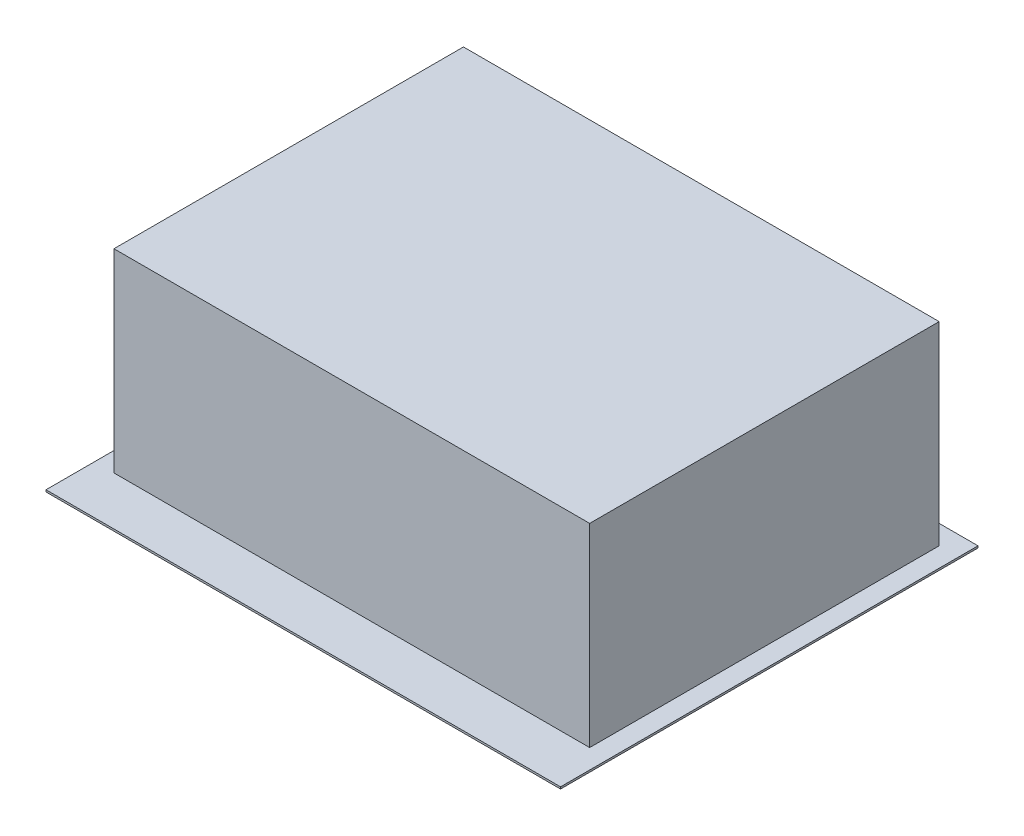
ISO-10303-21;
HEADER;
FILE_DESCRIPTION(('STEP AP214'),'2;1');
FILE_NAME('part.step','',(''),(''),'','','');
FILE_SCHEMA(('AUTOMOTIVE_DESIGN { 1 0 10303 214 1 1 1 1 }'));
ENDSEC;
DATA;
#1=APPLICATION_CONTEXT('core data for automotive mechanical design processes');
#2=APPLICATION_PROTOCOL_DEFINITION('international standard','automotive_design',2000,#1);
#3=PRODUCT_CONTEXT('',#1,'mechanical');
#4=PRODUCT('Part','Part','',(#3));
#5=PRODUCT_RELATED_PRODUCT_CATEGORY('part','',(#4));
#6=PRODUCT_DEFINITION_FORMATION('','',#4);
#7=PRODUCT_DEFINITION_CONTEXT('part definition',#1,'design');
#8=PRODUCT_DEFINITION('design','',#6,#7);
#9=PRODUCT_DEFINITION_SHAPE('','',#8);
#10=(LENGTH_UNIT() NAMED_UNIT(*) SI_UNIT(.MILLI.,.METRE.));
#11=(NAMED_UNIT(*) PLANE_ANGLE_UNIT() SI_UNIT($,.RADIAN.));
#12=(NAMED_UNIT(*) SI_UNIT($,.STERADIAN.) SOLID_ANGLE_UNIT());
#13=UNCERTAINTY_MEASURE_WITH_UNIT(LENGTH_MEASURE(1.E-05),#10,'distance_accuracy_value','');
#14=(GEOMETRIC_REPRESENTATION_CONTEXT(3) GLOBAL_UNCERTAINTY_ASSIGNED_CONTEXT((#13)) GLOBAL_UNIT_ASSIGNED_CONTEXT((#10,
#11,#12)) REPRESENTATION_CONTEXT('',''));
#15=CARTESIAN_POINT('',(0.,0.,0.));
#16=DIRECTION('',(0.,0.,1.));
#17=DIRECTION('',(1.,0.,0.));
#18=AXIS2_PLACEMENT_3D('',#15,#16,#17);
#19=CARTESIAN_POINT('',(22.,192.,-410.));
#20=DIRECTION('',(1.,0.,0.));
#21=DIRECTION('',(0.,0.,-1.));
#22=AXIS2_PLACEMENT_3D('',#19,#20,#21);
#23=PLANE('',#22);
#24=DIRECTION('',(0.,0.,1.));
#25=VECTOR('',#24,1.);
#26=CARTESIAN_POINT('',(22.,192.,-410.));
#27=LINE('',#26,#25);
#28=CARTESIAN_POINT('',(22.,192.,-408.));
#29=VERTEX_POINT('',#28);
#30=CARTESIAN_POINT('',(22.,192.,-402.));
#31=VERTEX_POINT('',#30);
#32=EDGE_CURVE('E153',#29,#31,#27,.T.);
#33=ORIENTED_EDGE('',*,*,#32,.T.);
#34=DIRECTION('',(0.,-1.,0.));
#35=VECTOR('',#34,1.);
#36=CARTESIAN_POINT('',(22.,200.,-402.));
#37=LINE('',#36,#35);
#38=CARTESIAN_POINT('',(22.,200.,-402.));
#39=VERTEX_POINT('',#38);
#40=EDGE_CURVE('E59',#39,#31,#37,.T.);
#41=ORIENTED_EDGE('',*,*,#40,.F.);
#42=DIRECTION('',(0.,0.,-1.));
#43=VECTOR('',#42,1.);
#44=CARTESIAN_POINT('',(22.,200.,-52.));
#45=LINE('',#44,#43);
#46=CARTESIAN_POINT('',(22.,200.,-52.));
#47=VERTEX_POINT('',#46);
#48=EDGE_CURVE('E149',#47,#39,#45,.T.);
#49=ORIENTED_EDGE('',*,*,#48,.F.);
#50=DIRECTION('',(0.,-1.,0.));
#51=VECTOR('',#50,1.);
#52=CARTESIAN_POINT('',(22.,192.,-52.));
#53=LINE('',#52,#51);
#54=CARTESIAN_POINT('',(22.,0.,-52.));
#55=VERTEX_POINT('',#54);
#56=EDGE_CURVE('E207',#47,#55,#53,.T.);
#57=ORIENTED_EDGE('',*,*,#56,.T.);
#58=DIRECTION('',(0.,0.,-1.));
#59=VECTOR('',#58,1.);
#60=CARTESIAN_POINT('',(22.,0.,-52.));
#61=LINE('',#60,#59);
#62=CARTESIAN_POINT('',(22.,0.,-402.));
#63=VERTEX_POINT('',#62);
#64=EDGE_CURVE('E51',#55,#63,#61,.T.);
#65=ORIENTED_EDGE('',*,*,#64,.T.);
#66=CARTESIAN_POINT('',(22.,12.,-402.));
#67=VERTEX_POINT('',#66);
#68=EDGE_CURVE('E155',#67,#63,#37,.T.);
#69=ORIENTED_EDGE('',*,*,#68,.F.);
#70=DIRECTION('',(0.,0.,1.));
#71=VECTOR('',#70,1.);
#72=CARTESIAN_POINT('',(22.,12.,-410.));
#73=LINE('',#72,#71);
#74=CARTESIAN_POINT('',(22.,12.,-408.));
#75=VERTEX_POINT('',#74);
#76=EDGE_CURVE('E187',#75,#67,#73,.T.);
#77=ORIENTED_EDGE('',*,*,#76,.F.);
#78=DIRECTION('',(0.,-1.,0.));
#79=VECTOR('',#78,1.);
#80=CARTESIAN_POINT('',(22.,192.,-408.));
#81=LINE('',#80,#79);
#82=EDGE_CURVE('E194',#29,#75,#81,.T.);
#83=ORIENTED_EDGE('',*,*,#82,.F.);
#84=EDGE_LOOP('',(#33,#41,#49,#57,#65,#69,#77,#83));
#85=FACE_BOUND('',#84,.T.);
#86=ADVANCED_FACE('F36',(#85),#23,.T.);
#87=CARTESIAN_POINT('',(20.,192.,-52.));
#88=DIRECTION('',(0.,0.,-1.));
#89=DIRECTION('',(-1.,0.,0.));
#90=AXIS2_PLACEMENT_3D('',#87,#88,#89);
#91=PLANE('',#90);
#92=DIRECTION('',(0.,-1.,0.));
#93=VECTOR('',#92,1.);
#94=CARTESIAN_POINT('',(508.,192.,-52.));
#95=LINE('',#94,#93);
#96=CARTESIAN_POINT('',(508.,200.,-52.));
#97=VERTEX_POINT('',#96);
#98=CARTESIAN_POINT('',(508.,0.,-52.));
#99=VERTEX_POINT('',#98);
#100=EDGE_CURVE('E205',#97,#99,#95,.T.);
#101=ORIENTED_EDGE('',*,*,#100,.T.);
#102=DIRECTION('',(-1.,0.,0.));
#103=VECTOR('',#102,1.);
#104=CARTESIAN_POINT('',(22.,0.,-52.));
#105=LINE('',#104,#103);
#106=EDGE_CURVE('E170',#99,#55,#105,.T.);
#107=ORIENTED_EDGE('',*,*,#106,.T.);
#108=ORIENTED_EDGE('',*,*,#56,.F.);
#109=DIRECTION('',(-1.,0.,0.));
#110=VECTOR('',#109,1.);
#111=CARTESIAN_POINT('',(22.,200.,-52.));
#112=LINE('',#111,#110);
#113=EDGE_CURVE('E169',#97,#47,#112,.T.);
#114=ORIENTED_EDGE('',*,*,#113,.F.);
#115=EDGE_LOOP('',(#101,#107,#108,#114));
#116=FACE_BOUND('',#115,.T.);
#117=ADVANCED_FACE('F319',(#116),#91,.T.);
#118=CARTESIAN_POINT('',(508.,192.,-410.));
#119=DIRECTION('',(-1.,0.,0.));
#120=DIRECTION('',(0.,0.,1.));
#121=AXIS2_PLACEMENT_3D('',#118,#119,#120);
#122=PLANE('',#121);
#123=DIRECTION('',(0.,0.,-1.));
#124=VECTOR('',#123,1.);
#125=CARTESIAN_POINT('',(508.,12.,-410.));
#126=LINE('',#125,#124);
#127=CARTESIAN_POINT('',(508.,12.,-402.));
#128=VERTEX_POINT('',#127);
#129=CARTESIAN_POINT('',(508.,12.,-408.));
#130=VERTEX_POINT('',#129);
#131=EDGE_CURVE('E197',#128,#130,#126,.T.);
#132=ORIENTED_EDGE('',*,*,#131,.F.);
#133=DIRECTION('',(0.,-1.,0.));
#134=VECTOR('',#133,1.);
#135=CARTESIAN_POINT('',(508.,200.,-402.));
#136=LINE('',#135,#134);
#137=CARTESIAN_POINT('',(508.,0.,-402.));
#138=VERTEX_POINT('',#137);
#139=EDGE_CURVE('E154',#128,#138,#136,.T.);
#140=ORIENTED_EDGE('',*,*,#139,.T.);
#141=DIRECTION('',(0.,0.,1.));
#142=VECTOR('',#141,1.);
#143=CARTESIAN_POINT('',(508.,0.,-52.));
#144=LINE('',#143,#142);
#145=EDGE_CURVE('E173',#138,#99,#144,.T.);
#146=ORIENTED_EDGE('',*,*,#145,.T.);
#147=ORIENTED_EDGE('',*,*,#100,.F.);
#148=DIRECTION('',(0.,0.,1.));
#149=VECTOR('',#148,1.);
#150=CARTESIAN_POINT('',(508.,200.,-52.));
#151=LINE('',#150,#149);
#152=CARTESIAN_POINT('',(508.,200.,-402.));
#153=VERTEX_POINT('',#152);
#154=EDGE_CURVE('E165',#153,#97,#151,.T.);
#155=ORIENTED_EDGE('',*,*,#154,.F.);
#156=CARTESIAN_POINT('',(508.,192.,-402.));
#157=VERTEX_POINT('',#156);
#158=EDGE_CURVE('E161',#153,#157,#136,.T.);
#159=ORIENTED_EDGE('',*,*,#158,.T.);
#160=DIRECTION('',(0.,0.,-1.));
#161=VECTOR('',#160,1.);
#162=CARTESIAN_POINT('',(508.,192.,-410.));
#163=LINE('',#162,#161);
#164=CARTESIAN_POINT('',(508.,192.,-408.));
#165=VERTEX_POINT('',#164);
#166=EDGE_CURVE('E189',#157,#165,#163,.T.);
#167=ORIENTED_EDGE('',*,*,#166,.T.);
#168=DIRECTION('',(0.,-1.,0.));
#169=VECTOR('',#168,1.);
#170=CARTESIAN_POINT('',(508.,192.,-408.));
#171=LINE('',#170,#169);
#172=EDGE_CURVE('E202',#165,#130,#171,.T.);
#173=ORIENTED_EDGE('',*,*,#172,.T.);
#174=EDGE_LOOP('',(#132,#140,#146,#147,#155,#159,#167,#173));
#175=FACE_BOUND('',#174,.T.);
#176=ADVANCED_FACE('F324',(#175),#122,.T.);
#177=CARTESIAN_POINT('',(20.,192.,-408.));
#178=DIRECTION('',(0.,0.,1.));
#179=DIRECTION('',(1.,0.,0.));
#180=AXIS2_PLACEMENT_3D('',#177,#178,#179);
#181=PLANE('',#180);
#182=DIRECTION('',(-1.,0.,0.));
#183=VECTOR('',#182,1.);
#184=CARTESIAN_POINT('',(20.,12.,-408.));
#185=LINE('',#184,#183);
#186=EDGE_CURVE('E190',#130,#75,#185,.T.);
#187=ORIENTED_EDGE('',*,*,#186,.F.);
#188=ORIENTED_EDGE('',*,*,#172,.F.);
#189=DIRECTION('',(-1.,0.,0.));
#190=VECTOR('',#189,1.);
#191=CARTESIAN_POINT('',(20.,192.,-408.));
#192=LINE('',#191,#190);
#193=EDGE_CURVE('E192',#165,#29,#192,.T.);
#194=ORIENTED_EDGE('',*,*,#193,.T.);
#195=ORIENTED_EDGE('',*,*,#82,.T.);
#196=EDGE_LOOP('',(#187,#188,#194,#195));
#197=FACE_BOUND('',#196,.T.);
#198=ADVANCED_FACE('F346',(#197),#181,.T.);
#199=CARTESIAN_POINT('',(0.,192.,0.));
#200=DIRECTION('',(0.,1.,0.));
#201=DIRECTION('',(0.,0.,1.));
#202=AXIS2_PLACEMENT_3D('',#199,#200,#201);
#203=PLANE('',#202);
#204=ORIENTED_EDGE('',*,*,#166,.F.);
#205=DIRECTION('',(-1.,0.,0.));
#206=VECTOR('',#205,1.);
#207=CARTESIAN_POINT('',(0.,192.,-402.));
#208=LINE('',#207,#206);
#209=EDGE_CURVE('E184',#157,#31,#208,.T.);
#210=ORIENTED_EDGE('',*,*,#209,.T.);
#211=ORIENTED_EDGE('',*,*,#32,.F.);
#212=ORIENTED_EDGE('',*,*,#193,.F.);
#213=EDGE_LOOP('',(#204,#210,#211,#212));
#214=FACE_BOUND('',#213,.T.);
#215=ADVANCED_FACE('F350',(#214),#203,.F.);
#216=CARTESIAN_POINT('',(0.,12.,0.));
#217=DIRECTION('',(0.,1.,0.));
#218=DIRECTION('',(0.,0.,1.));
#219=AXIS2_PLACEMENT_3D('',#216,#217,#218);
#220=PLANE('',#219);
#221=DIRECTION('',(-1.,0.,0.));
#222=VECTOR('',#221,1.);
#223=CARTESIAN_POINT('',(0.,12.,-402.));
#224=LINE('',#223,#222);
#225=EDGE_CURVE('E11',#128,#67,#224,.T.);
#226=ORIENTED_EDGE('',*,*,#225,.F.);
#227=ORIENTED_EDGE('',*,*,#131,.T.);
#228=ORIENTED_EDGE('',*,*,#186,.T.);
#229=ORIENTED_EDGE('',*,*,#76,.T.);
#230=EDGE_LOOP('',(#226,#227,#228,#229));
#231=FACE_BOUND('',#230,.T.);
#232=ADVANCED_FACE('F383',(#231),#220,.T.);
#233=CARTESIAN_POINT('',(22.,200.,-402.));
#234=DIRECTION('',(0.,0.,-1.));
#235=DIRECTION('',(-1.,0.,0.));
#236=AXIS2_PLACEMENT_3D('',#233,#234,#235);
#237=PLANE('',#236);
#238=ORIENTED_EDGE('',*,*,#225,.T.);
#239=ORIENTED_EDGE('',*,*,#68,.T.);
#240=DIRECTION('',(1.,0.,0.));
#241=VECTOR('',#240,1.);
#242=CARTESIAN_POINT('',(22.,0.,-402.));
#243=LINE('',#242,#241);
#244=EDGE_CURVE('E179',#63,#138,#243,.T.);
#245=ORIENTED_EDGE('',*,*,#244,.T.);
#246=ORIENTED_EDGE('',*,*,#139,.F.);
#247=EDGE_LOOP('',(#238,#239,#245,#246));
#248=FACE_BOUND('',#247,.T.);
#249=ADVANCED_FACE('F392',(#248),#237,.F.);
#250=ORIENTED_EDGE('',*,*,#158,.F.);
#251=DIRECTION('',(1.,0.,0.));
#252=VECTOR('',#251,1.);
#253=CARTESIAN_POINT('',(22.,200.,-402.));
#254=LINE('',#253,#252);
#255=EDGE_CURVE('E158',#39,#153,#254,.T.);
#256=ORIENTED_EDGE('',*,*,#255,.F.);
#257=ORIENTED_EDGE('',*,*,#40,.T.);
#258=ORIENTED_EDGE('',*,*,#209,.F.);
#259=EDGE_LOOP('',(#250,#256,#257,#258));
#260=FACE_BOUND('',#259,.T.);
#261=ADVANCED_FACE('F159',(#260),#237,.F.);
#262=CARTESIAN_POINT('',(0.,200.,0.));
#263=DIRECTION('',(0.,-1.,0.));
#264=DIRECTION('',(0.,0.,-1.));
#265=AXIS2_PLACEMENT_3D('',#262,#263,#264);
#266=PLANE('',#265);
#267=ORIENTED_EDGE('',*,*,#48,.T.);
#268=ORIENTED_EDGE('',*,*,#255,.T.);
#269=ORIENTED_EDGE('',*,*,#154,.T.);
#270=ORIENTED_EDGE('',*,*,#113,.T.);
#271=EDGE_LOOP('',(#267,#268,#269,#270));
#272=FACE_BOUND('',#271,.T.);
#273=ADVANCED_FACE('F167',(#272),#266,.T.);
#274=CARTESIAN_POINT('',(0.,2.,0.));
#275=DIRECTION('',(0.,-1.,0.));
#276=DIRECTION('',(0.,0.,-1.));
#277=AXIS2_PLACEMENT_3D('',#274,#275,#276);
#278=PLANE('',#277);
#279=DIRECTION('',(0.,0.,1.));
#280=VECTOR('',#279,1.);
#281=CARTESIAN_POINT('',(0.,2.,0.));
#282=LINE('',#281,#280);
#283=CARTESIAN_POINT('',(0.,2.,-430.));
#284=VERTEX_POINT('',#283);
#285=CARTESIAN_POINT('',(0.,2.,0.));
#286=VERTEX_POINT('',#285);
#287=EDGE_CURVE('E243',#284,#286,#282,.T.);
#288=ORIENTED_EDGE('',*,*,#287,.T.);
#289=DIRECTION('',(1.,0.,0.));
#290=VECTOR('',#289,1.);
#291=CARTESIAN_POINT('',(0.,2.,0.));
#292=LINE('',#291,#290);
#293=CARTESIAN_POINT('',(530.,2.,0.));
#294=VERTEX_POINT('',#293);
#295=EDGE_CURVE('E246',#286,#294,#292,.T.);
#296=ORIENTED_EDGE('',*,*,#295,.T.);
#297=DIRECTION('',(0.,0.,-1.));
#298=VECTOR('',#297,1.);
#299=CARTESIAN_POINT('',(530.,2.,0.));
#300=LINE('',#299,#298);
#301=CARTESIAN_POINT('',(530.,2.,-430.));
#302=VERTEX_POINT('',#301);
#303=EDGE_CURVE('E249',#294,#302,#300,.T.);
#304=ORIENTED_EDGE('',*,*,#303,.T.);
#305=DIRECTION('',(-1.,0.,0.));
#306=VECTOR('',#305,1.);
#307=CARTESIAN_POINT('',(0.,2.,-430.));
#308=LINE('',#307,#306);
#309=EDGE_CURVE('E251',#302,#284,#308,.T.);
#310=ORIENTED_EDGE('',*,*,#309,.T.);
#311=EDGE_LOOP('',(#288,#296,#304,#310));
#312=FACE_BOUND('',#311,.T.);
#313=DIRECTION('',(0.,0.,1.));
#314=VECTOR('',#313,1.);
#315=CARTESIAN_POINT('',(20.,2.,-410.));
#316=LINE('',#315,#314);
#317=CARTESIAN_POINT('',(20.,2.,-410.));
#318=VERTEX_POINT('',#317);
#319=CARTESIAN_POINT('',(20.,2.,-50.));
#320=VERTEX_POINT('',#319);
#321=EDGE_CURVE('E209',#318,#320,#316,.T.);
#322=ORIENTED_EDGE('',*,*,#321,.F.);
#323=DIRECTION('',(-1.,0.,0.));
#324=VECTOR('',#323,1.);
#325=CARTESIAN_POINT('',(20.,2.,-410.));
#326=LINE('',#325,#324);
#327=CARTESIAN_POINT('',(510.,2.,-410.));
#328=VERTEX_POINT('',#327);
#329=EDGE_CURVE('E214',#328,#318,#326,.T.);
#330=ORIENTED_EDGE('',*,*,#329,.F.);
#331=DIRECTION('',(0.,0.,-1.));
#332=VECTOR('',#331,1.);
#333=CARTESIAN_POINT('',(510.,2.,-410.));
#334=LINE('',#333,#332);
#335=CARTESIAN_POINT('',(510.,2.,-50.));
#336=VERTEX_POINT('',#335);
#337=EDGE_CURVE('E226',#336,#328,#334,.T.);
#338=ORIENTED_EDGE('',*,*,#337,.F.);
#339=DIRECTION('',(1.,0.,0.));
#340=VECTOR('',#339,1.);
#341=CARTESIAN_POINT('',(20.,2.,-50.));
#342=LINE('',#341,#340);
#343=EDGE_CURVE('E223',#320,#336,#342,.T.);
#344=ORIENTED_EDGE('',*,*,#343,.F.);
#345=EDGE_LOOP('',(#322,#330,#338,#344));
#346=FACE_BOUND('',#345,.T.);
#347=ADVANCED_FACE('F289',(#312,#346),#278,.F.);
#348=CARTESIAN_POINT('',(0.,2.,0.));
#349=DIRECTION('',(1.,0.,0.));
#350=DIRECTION('',(0.,0.,-1.));
#351=AXIS2_PLACEMENT_3D('',#348,#349,#350);
#352=PLANE('',#351);
#353=DIRECTION('',(0.,0.,1.));
#354=VECTOR('',#353,1.);
#355=CARTESIAN_POINT('',(0.,0.,0.));
#356=LINE('',#355,#354);
#357=CARTESIAN_POINT('',(0.,0.,-430.));
#358=VERTEX_POINT('',#357);
#359=CARTESIAN_POINT('',(0.,0.,0.));
#360=VERTEX_POINT('',#359);
#361=EDGE_CURVE('E242',#358,#360,#356,.T.);
#362=ORIENTED_EDGE('',*,*,#361,.T.);
#363=DIRECTION('',(0.,-1.,0.));
#364=VECTOR('',#363,1.);
#365=CARTESIAN_POINT('',(0.,2.,0.));
#366=LINE('',#365,#364);
#367=EDGE_CURVE('E44',#286,#360,#366,.T.);
#368=ORIENTED_EDGE('',*,*,#367,.F.);
#369=ORIENTED_EDGE('',*,*,#287,.F.);
#370=DIRECTION('',(0.,-1.,0.));
#371=VECTOR('',#370,1.);
#372=CARTESIAN_POINT('',(0.,2.,-430.));
#373=LINE('',#372,#371);
#374=EDGE_CURVE('E253',#284,#358,#373,.T.);
#375=ORIENTED_EDGE('',*,*,#374,.T.);
#376=EDGE_LOOP('',(#362,#368,#369,#375));
#377=FACE_BOUND('',#376,.T.);
#378=ADVANCED_FACE('F38',(#377),#352,.F.);
#379=CARTESIAN_POINT('',(0.,2.,0.));
#380=DIRECTION('',(0.,0.,-1.));
#381=DIRECTION('',(-1.,0.,0.));
#382=AXIS2_PLACEMENT_3D('',#379,#380,#381);
#383=PLANE('',#382);
#384=DIRECTION('',(1.,0.,0.));
#385=VECTOR('',#384,1.);
#386=CARTESIAN_POINT('',(0.,0.,0.));
#387=LINE('',#386,#385);
#388=CARTESIAN_POINT('',(530.,0.,0.));
#389=VERTEX_POINT('',#388);
#390=EDGE_CURVE('E256',#360,#389,#387,.T.);
#391=ORIENTED_EDGE('',*,*,#390,.T.);
#392=DIRECTION('',(0.,-1.,0.));
#393=VECTOR('',#392,1.);
#394=CARTESIAN_POINT('',(530.,2.,0.));
#395=LINE('',#394,#393);
#396=EDGE_CURVE('E266',#294,#389,#395,.T.);
#397=ORIENTED_EDGE('',*,*,#396,.F.);
#398=ORIENTED_EDGE('',*,*,#295,.F.);
#399=ORIENTED_EDGE('',*,*,#367,.T.);
#400=EDGE_LOOP('',(#391,#397,#398,#399));
#401=FACE_BOUND('',#400,.T.);
#402=ADVANCED_FACE('F271',(#401),#383,.F.);
#403=CARTESIAN_POINT('',(530.,2.,0.));
#404=DIRECTION('',(-1.,0.,0.));
#405=DIRECTION('',(0.,0.,1.));
#406=AXIS2_PLACEMENT_3D('',#403,#404,#405);
#407=PLANE('',#406);
#408=DIRECTION('',(0.,0.,-1.));
#409=VECTOR('',#408,1.);
#410=CARTESIAN_POINT('',(530.,0.,0.));
#411=LINE('',#410,#409);
#412=CARTESIAN_POINT('',(530.,0.,-430.));
#413=VERTEX_POINT('',#412);
#414=EDGE_CURVE('E258',#389,#413,#411,.T.);
#415=ORIENTED_EDGE('',*,*,#414,.T.);
#416=DIRECTION('',(0.,-1.,0.));
#417=VECTOR('',#416,1.);
#418=CARTESIAN_POINT('',(530.,2.,-430.));
#419=LINE('',#418,#417);
#420=EDGE_CURVE('E263',#302,#413,#419,.T.);
#421=ORIENTED_EDGE('',*,*,#420,.F.);
#422=ORIENTED_EDGE('',*,*,#303,.F.);
#423=ORIENTED_EDGE('',*,*,#396,.T.);
#424=EDGE_LOOP('',(#415,#421,#422,#423));
#425=FACE_BOUND('',#424,.T.);
#426=ADVANCED_FACE('F283',(#425),#407,.F.);
#427=CARTESIAN_POINT('',(0.,2.,-430.));
#428=DIRECTION('',(0.,0.,1.));
#429=DIRECTION('',(1.,0.,0.));
#430=AXIS2_PLACEMENT_3D('',#427,#428,#429);
#431=PLANE('',#430);
#432=DIRECTION('',(-1.,0.,0.));
#433=VECTOR('',#432,1.);
#434=CARTESIAN_POINT('',(0.,0.,-430.));
#435=LINE('',#434,#433);
#436=EDGE_CURVE('E247',#413,#358,#435,.T.);
#437=ORIENTED_EDGE('',*,*,#436,.T.);
#438=ORIENTED_EDGE('',*,*,#374,.F.);
#439=ORIENTED_EDGE('',*,*,#309,.F.);
#440=ORIENTED_EDGE('',*,*,#420,.T.);
#441=EDGE_LOOP('',(#437,#438,#439,#440));
#442=FACE_BOUND('',#441,.T.);
#443=ADVANCED_FACE('F287',(#442),#431,.F.);
#444=CARTESIAN_POINT('',(0.,0.,0.));
#445=DIRECTION('',(0.,-1.,0.));
#446=DIRECTION('',(0.,0.,-1.));
#447=AXIS2_PLACEMENT_3D('',#444,#445,#446);
#448=PLANE('',#447);
#449=ORIENTED_EDGE('',*,*,#64,.F.);
#450=ORIENTED_EDGE('',*,*,#106,.F.);
#451=ORIENTED_EDGE('',*,*,#145,.F.);
#452=ORIENTED_EDGE('',*,*,#244,.F.);
#453=EDGE_LOOP('',(#449,#450,#451,#452));
#454=FACE_BOUND('',#453,.T.);
#455=ORIENTED_EDGE('',*,*,#361,.F.);
#456=ORIENTED_EDGE('',*,*,#436,.F.);
#457=ORIENTED_EDGE('',*,*,#414,.F.);
#458=ORIENTED_EDGE('',*,*,#390,.F.);
#459=EDGE_LOOP('',(#455,#456,#457,#458));
#460=FACE_BOUND('',#459,.T.);
#461=ADVANCED_FACE('F279',(#454,#460),#448,.T.);
#462=CARTESIAN_POINT('',(20.,202.,-410.));
#463=DIRECTION('',(1.,0.,0.));
#464=DIRECTION('',(0.,0.,-1.));
#465=AXIS2_PLACEMENT_3D('',#462,#463,#464);
#466=PLANE('',#465);
#467=ORIENTED_EDGE('',*,*,#321,.T.);
#468=DIRECTION('',(0.,-1.,0.));
#469=VECTOR('',#468,1.);
#470=CARTESIAN_POINT('',(20.,202.,-50.));
#471=LINE('',#470,#469);
#472=CARTESIAN_POINT('',(20.,202.,-50.));
#473=VERTEX_POINT('',#472);
#474=EDGE_CURVE('E239',#473,#320,#471,.T.);
#475=ORIENTED_EDGE('',*,*,#474,.F.);
#476=DIRECTION('',(0.,0.,1.));
#477=VECTOR('',#476,1.);
#478=CARTESIAN_POINT('',(20.,202.,-410.));
#479=LINE('',#478,#477);
#480=CARTESIAN_POINT('',(20.,202.,-410.));
#481=VERTEX_POINT('',#480);
#482=EDGE_CURVE('E210',#481,#473,#479,.T.);
#483=ORIENTED_EDGE('',*,*,#482,.F.);
#484=DIRECTION('',(0.,-1.,0.));
#485=VECTOR('',#484,1.);
#486=CARTESIAN_POINT('',(20.,202.,-410.));
#487=LINE('',#486,#485);
#488=EDGE_CURVE('E220',#481,#318,#487,.T.);
#489=ORIENTED_EDGE('',*,*,#488,.T.);
#490=EDGE_LOOP('',(#467,#475,#483,#489));
#491=FACE_BOUND('',#490,.T.);
#492=ADVANCED_FACE('F301',(#491),#466,.F.);
#493=CARTESIAN_POINT('',(20.,202.,-50.));
#494=DIRECTION('',(0.,0.,-1.));
#495=DIRECTION('',(-1.,0.,0.));
#496=AXIS2_PLACEMENT_3D('',#493,#494,#495);
#497=PLANE('',#496);
#498=ORIENTED_EDGE('',*,*,#343,.T.);
#499=DIRECTION('',(0.,-1.,0.));
#500=VECTOR('',#499,1.);
#501=CARTESIAN_POINT('',(510.,202.,-50.));
#502=LINE('',#501,#500);
#503=CARTESIAN_POINT('',(510.,202.,-50.));
#504=VERTEX_POINT('',#503);
#505=EDGE_CURVE('E236',#504,#336,#502,.T.);
#506=ORIENTED_EDGE('',*,*,#505,.F.);
#507=DIRECTION('',(1.,0.,0.));
#508=VECTOR('',#507,1.);
#509=CARTESIAN_POINT('',(20.,202.,-50.));
#510=LINE('',#509,#508);
#511=EDGE_CURVE('E213',#473,#504,#510,.T.);
#512=ORIENTED_EDGE('',*,*,#511,.F.);
#513=ORIENTED_EDGE('',*,*,#474,.T.);
#514=EDGE_LOOP('',(#498,#506,#512,#513));
#515=FACE_BOUND('',#514,.T.);
#516=ADVANCED_FACE('F309',(#515),#497,.F.);
#517=CARTESIAN_POINT('',(510.,202.,-410.));
#518=DIRECTION('',(-1.,0.,0.));
#519=DIRECTION('',(0.,0.,1.));
#520=AXIS2_PLACEMENT_3D('',#517,#518,#519);
#521=PLANE('',#520);
#522=ORIENTED_EDGE('',*,*,#337,.T.);
#523=DIRECTION('',(0.,-1.,0.));
#524=VECTOR('',#523,1.);
#525=CARTESIAN_POINT('',(510.,202.,-410.));
#526=LINE('',#525,#524);
#527=CARTESIAN_POINT('',(510.,202.,-410.));
#528=VERTEX_POINT('',#527);
#529=EDGE_CURVE('E233',#528,#328,#526,.T.);
#530=ORIENTED_EDGE('',*,*,#529,.F.);
#531=DIRECTION('',(0.,0.,-1.));
#532=VECTOR('',#531,1.);
#533=CARTESIAN_POINT('',(510.,202.,-410.));
#534=LINE('',#533,#532);
#535=EDGE_CURVE('E216',#504,#528,#534,.T.);
#536=ORIENTED_EDGE('',*,*,#535,.F.);
#537=ORIENTED_EDGE('',*,*,#505,.T.);
#538=EDGE_LOOP('',(#522,#530,#536,#537));
#539=FACE_BOUND('',#538,.T.);
#540=ADVANCED_FACE('F307',(#539),#521,.F.);
#541=CARTESIAN_POINT('',(20.,202.,-410.));
#542=DIRECTION('',(0.,0.,1.));
#543=DIRECTION('',(1.,0.,0.));
#544=AXIS2_PLACEMENT_3D('',#541,#542,#543);
#545=PLANE('',#544);
#546=ORIENTED_EDGE('',*,*,#329,.T.);
#547=ORIENTED_EDGE('',*,*,#488,.F.);
#548=DIRECTION('',(-1.,0.,0.));
#549=VECTOR('',#548,1.);
#550=CARTESIAN_POINT('',(20.,202.,-410.));
#551=LINE('',#550,#549);
#552=EDGE_CURVE('E218',#528,#481,#551,.T.);
#553=ORIENTED_EDGE('',*,*,#552,.F.);
#554=ORIENTED_EDGE('',*,*,#529,.T.);
#555=EDGE_LOOP('',(#546,#547,#553,#554));
#556=FACE_BOUND('',#555,.T.);
#557=ADVANCED_FACE('F297',(#556),#545,.F.);
#558=CARTESIAN_POINT('',(0.,202.,0.));
#559=DIRECTION('',(0.,1.,0.));
#560=DIRECTION('',(0.,0.,1.));
#561=AXIS2_PLACEMENT_3D('',#558,#559,#560);
#562=PLANE('',#561);
#563=ORIENTED_EDGE('',*,*,#482,.T.);
#564=ORIENTED_EDGE('',*,*,#511,.T.);
#565=ORIENTED_EDGE('',*,*,#535,.T.);
#566=ORIENTED_EDGE('',*,*,#552,.T.);
#567=EDGE_LOOP('',(#563,#564,#565,#566));
#568=FACE_BOUND('',#567,.T.);
#569=ADVANCED_FACE('F303',(#568),#562,.T.);
#570=CLOSED_SHELL('',(#86,#117,#176,#198,#215,#232,#249,#261,#273,#347,#378,#402,#426,#443,#461,
#492,#516,#540,#557,#569));
#571=MANIFOLD_SOLID_BREP('B2',#570);
#572=ADVANCED_BREP_SHAPE_REPRESENTATION('',(#18,#571),#14);
#573=SHAPE_DEFINITION_REPRESENTATION(#9,#572);
ENDSEC;
END-ISO-10303-21;
